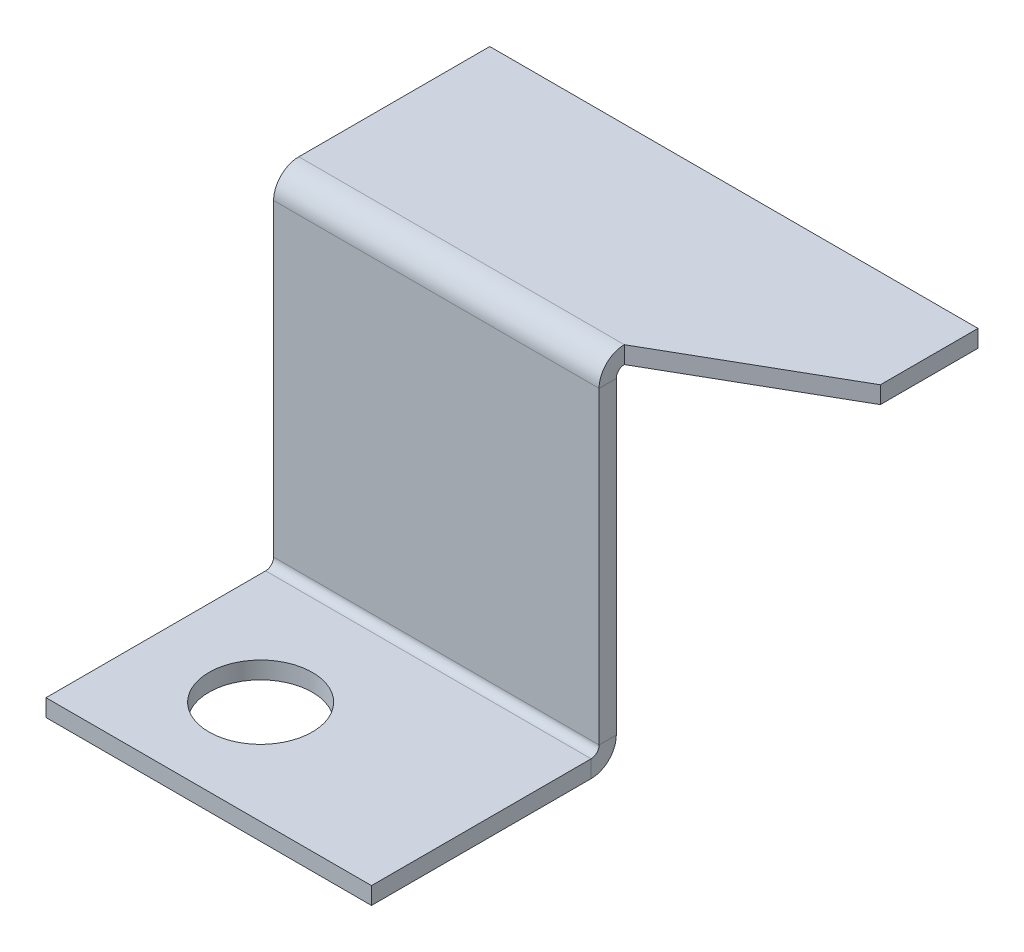
ISO-10303-21;
HEADER;
FILE_DESCRIPTION(('STEP AP214'),'2;1');
FILE_NAME('part.step','',(''),(''),'','','');
FILE_SCHEMA(('AUTOMOTIVE_DESIGN { 1 0 10303 214 1 1 1 1 }'));
ENDSEC;
DATA;
#1=APPLICATION_CONTEXT('core data for automotive mechanical design processes');
#2=APPLICATION_PROTOCOL_DEFINITION('international standard','automotive_design',2000,#1);
#3=PRODUCT_CONTEXT('',#1,'mechanical');
#4=PRODUCT('Part','Part','',(#3));
#5=PRODUCT_RELATED_PRODUCT_CATEGORY('part','',(#4));
#6=PRODUCT_DEFINITION_FORMATION('','',#4);
#7=PRODUCT_DEFINITION_CONTEXT('part definition',#1,'design');
#8=PRODUCT_DEFINITION('design','',#6,#7);
#9=PRODUCT_DEFINITION_SHAPE('','',#8);
#10=(LENGTH_UNIT() NAMED_UNIT(*) SI_UNIT(.MILLI.,.METRE.));
#11=(NAMED_UNIT(*) PLANE_ANGLE_UNIT() SI_UNIT($,.RADIAN.));
#12=(NAMED_UNIT(*) SI_UNIT($,.STERADIAN.) SOLID_ANGLE_UNIT());
#13=UNCERTAINTY_MEASURE_WITH_UNIT(LENGTH_MEASURE(1.E-05),#10,'distance_accuracy_value','');
#14=(GEOMETRIC_REPRESENTATION_CONTEXT(3) GLOBAL_UNCERTAINTY_ASSIGNED_CONTEXT((#13)) GLOBAL_UNIT_ASSIGNED_CONTEXT((#10,
#11,#12)) REPRESENTATION_CONTEXT('',''));
#15=CARTESIAN_POINT('',(0.,0.,0.));
#16=DIRECTION('',(0.,0.,1.));
#17=DIRECTION('',(1.,0.,0.));
#18=AXIS2_PLACEMENT_3D('',#15,#16,#17);
#19=CARTESIAN_POINT('',(-22.5,-33.1134,19.9241000000001));
#20=DIRECTION('',(1.,0.,0.));
#21=DIRECTION('',(0.,1.,0.));
#22=AXIS2_PLACEMENT_3D('',#19,#20,#21);
#23=PLANE('',#22);
#24=DIRECTION('',(0.,0.,-1.));
#25=VECTOR('',#24,1.);
#26=CARTESIAN_POINT('',(-22.5,-30.7893,19.9241000000001));
#27=LINE('',#26,#25);
#28=CARTESIAN_POINT('',(-22.5,-30.7893,19.9241000000001));
#29=VERTEX_POINT('',#28);
#30=CARTESIAN_POINT('',(-22.5,-30.7893,18.3366000000001));
#31=VERTEX_POINT('',#30);
#32=EDGE_CURVE('E244',#29,#31,#27,.T.);
#33=ORIENTED_EDGE('',*,*,#32,.F.);
#34=DIRECTION('',(0.,-1.,0.));
#35=VECTOR('',#34,1.);
#36=CARTESIAN_POINT('',(-22.5,0.,19.9241));
#37=LINE('',#36,#35);
#38=CARTESIAN_POINT('',(-22.5,-2.3241,19.9241));
#39=VERTEX_POINT('',#38);
#40=EDGE_CURVE('E252',#39,#29,#37,.T.);
#41=ORIENTED_EDGE('',*,*,#40,.F.);
#42=DIRECTION('',(0.,0.,-1.));
#43=VECTOR('',#42,1.);
#44=CARTESIAN_POINT('',(-22.5,-2.3241,18.3366));
#45=LINE('',#44,#43);
#46=CARTESIAN_POINT('',(-22.5,-2.32409999999999,18.3366));
#47=VERTEX_POINT('',#46);
#48=EDGE_CURVE('E262',#47,#39,#45,.F.);
#49=ORIENTED_EDGE('',*,*,#48,.F.);
#50=DIRECTION('',(0.,1.,0.));
#51=VECTOR('',#50,1.);
#52=CARTESIAN_POINT('',(-22.5,-33.1134,18.3366000000001));
#53=LINE('',#52,#51);
#54=EDGE_CURVE('E257',#47,#31,#53,.F.);
#55=ORIENTED_EDGE('',*,*,#54,.T.);
#56=EDGE_LOOP('',(#33,#41,#49,#55));
#57=FACE_BOUND('',#56,.T.);
#58=ADVANCED_FACE('F79',(#57),#23,.F.);
#59=CARTESIAN_POINT('',(7.5,-1.58749999999999,19.9241));
#60=DIRECTION('',(-1.,0.,0.));
#61=DIRECTION('',(0.,0.,1.));
#62=AXIS2_PLACEMENT_3D('',#59,#60,#61);
#63=PLANE('',#62);
#64=DIRECTION('',(0.,0.,-1.));
#65=VECTOR('',#64,1.);
#66=CARTESIAN_POINT('',(7.5,-30.7893,19.9241000000001));
#67=LINE('',#66,#65);
#68=CARTESIAN_POINT('',(7.5,-30.7893,19.9241000000001));
#69=VERTEX_POINT('',#68);
#70=CARTESIAN_POINT('',(7.5,-30.7893,18.3366000000001));
#71=VERTEX_POINT('',#70);
#72=EDGE_CURVE('E233',#69,#71,#67,.T.);
#73=ORIENTED_EDGE('',*,*,#72,.T.);
#74=DIRECTION('',(0.,-1.,0.));
#75=VECTOR('',#74,1.);
#76=CARTESIAN_POINT('',(7.5,-1.5875,18.3366));
#77=LINE('',#76,#75);
#78=CARTESIAN_POINT('',(7.5,-2.32409999999999,18.3366));
#79=VERTEX_POINT('',#78);
#80=EDGE_CURVE('E255',#71,#79,#77,.F.);
#81=ORIENTED_EDGE('',*,*,#80,.T.);
#82=DIRECTION('',(0.,0.,-1.));
#83=VECTOR('',#82,1.);
#84=CARTESIAN_POINT('',(7.5,-2.3241,19.9241));
#85=LINE('',#84,#83);
#86=CARTESIAN_POINT('',(7.5,-2.32409999999999,19.9241));
#87=VERTEX_POINT('',#86);
#88=EDGE_CURVE('E246',#79,#87,#85,.F.);
#89=ORIENTED_EDGE('',*,*,#88,.T.);
#90=DIRECTION('',(0.,1.,0.));
#91=VECTOR('',#90,1.);
#92=CARTESIAN_POINT('',(7.5,0.,19.9241));
#93=LINE('',#92,#91);
#94=EDGE_CURVE('E249',#69,#87,#93,.T.);
#95=ORIENTED_EDGE('',*,*,#94,.F.);
#96=EDGE_LOOP('',(#73,#81,#89,#95));
#97=FACE_BOUND('',#96,.T.);
#98=ADVANCED_FACE('F336',(#97),#63,.F.);
#99=CARTESIAN_POINT('',(0.,0.,19.9241));
#100=DIRECTION('',(0.,0.,-1.));
#101=DIRECTION('',(0.,1.,0.));
#102=AXIS2_PLACEMENT_3D('',#99,#100,#101);
#103=PLANE('',#102);
#104=DIRECTION('',(1.,0.,0.));
#105=VECTOR('',#104,1.);
#106=CARTESIAN_POINT('',(7.5,-30.7893,19.9241000000001));
#107=LINE('',#106,#105);
#108=EDGE_CURVE('E239',#69,#29,#107,.F.);
#109=ORIENTED_EDGE('',*,*,#108,.F.);
#110=ORIENTED_EDGE('',*,*,#94,.T.);
#111=DIRECTION('',(-1.,0.,0.));
#112=VECTOR('',#111,1.);
#113=CARTESIAN_POINT('',(7.5,-2.3241,19.9241));
#114=LINE('',#113,#112);
#115=EDGE_CURVE('E260',#39,#87,#114,.F.);
#116=ORIENTED_EDGE('',*,*,#115,.F.);
#117=ORIENTED_EDGE('',*,*,#40,.T.);
#118=EDGE_LOOP('',(#109,#110,#116,#117));
#119=FACE_BOUND('',#118,.T.);
#120=ADVANCED_FACE('F346',(#119),#103,.F.);
#121=CARTESIAN_POINT('',(0.,0.,18.3366));
#122=DIRECTION('',(0.,0.,-1.));
#123=DIRECTION('',(0.,1.,0.));
#124=AXIS2_PLACEMENT_3D('',#121,#122,#123);
#125=PLANE('',#124);
#126=ORIENTED_EDGE('',*,*,#80,.F.);
#127=DIRECTION('',(1.,0.,0.));
#128=VECTOR('',#127,1.);
#129=CARTESIAN_POINT('',(7.5,-30.7893,18.3366000000001));
#130=LINE('',#129,#128);
#131=EDGE_CURVE('E228',#71,#31,#130,.F.);
#132=ORIENTED_EDGE('',*,*,#131,.T.);
#133=ORIENTED_EDGE('',*,*,#54,.F.);
#134=DIRECTION('',(-1.,0.,0.));
#135=VECTOR('',#134,1.);
#136=CARTESIAN_POINT('',(7.5,-2.3241,18.3366));
#137=LINE('',#136,#135);
#138=EDGE_CURVE('E265',#79,#47,#137,.T.);
#139=ORIENTED_EDGE('',*,*,#138,.F.);
#140=EDGE_LOOP('',(#126,#132,#133,#139));
#141=FACE_BOUND('',#140,.T.);
#142=ADVANCED_FACE('F339',(#141),#125,.T.);
#143=CARTESIAN_POINT('',(22.5,-1.5875,9.));
#144=DIRECTION('',(0.497384112444042,0.,0.867530428681468));
#145=DIRECTION('',(0.867530428681468,0.,-0.497384112444042));
#146=AXIS2_PLACEMENT_3D('',#143,#144,#145);
#147=PLANE('',#146);
#148=DIRECTION('',(0.867530428681468,0.,-0.497384112444042));
#149=VECTOR('',#148,1.);
#150=CARTESIAN_POINT('',(22.5,0.,9.));
#151=LINE('',#150,#149);
#152=CARTESIAN_POINT('',(7.5,0.,17.6));
#153=VERTEX_POINT('',#152);
#154=CARTESIAN_POINT('',(22.5,0.,9.));
#155=VERTEX_POINT('',#154);
#156=EDGE_CURVE('E270',#153,#155,#151,.T.);
#157=ORIENTED_EDGE('',*,*,#156,.F.);
#158=DIRECTION('',(0.,1.,0.));
#159=VECTOR('',#158,1.);
#160=CARTESIAN_POINT('',(7.5,-1.5875,17.6));
#161=LINE('',#160,#159);
#162=CARTESIAN_POINT('',(7.5,-1.5875,17.6));
#163=VERTEX_POINT('',#162);
#164=EDGE_CURVE('E13',#163,#153,#161,.T.);
#165=ORIENTED_EDGE('',*,*,#164,.F.);
#166=DIRECTION('',(0.867530428681468,0.,-0.497384112444042));
#167=VECTOR('',#166,1.);
#168=CARTESIAN_POINT('',(22.5,-1.5875,9.));
#169=LINE('',#168,#167);
#170=CARTESIAN_POINT('',(22.5,-1.5875,9.));
#171=VERTEX_POINT('',#170);
#172=EDGE_CURVE('E279',#163,#171,#169,.T.);
#173=ORIENTED_EDGE('',*,*,#172,.T.);
#174=DIRECTION('',(0.,1.,0.));
#175=VECTOR('',#174,1.);
#176=CARTESIAN_POINT('',(22.5,-1.5875,9.));
#177=LINE('',#176,#175);
#178=EDGE_CURVE('E83',#171,#155,#177,.T.);
#179=ORIENTED_EDGE('',*,*,#178,.T.);
#180=EDGE_LOOP('',(#157,#165,#173,#179));
#181=FACE_BOUND('',#180,.T.);
#182=ADVANCED_FACE('F81',(#181),#147,.T.);
#183=CARTESIAN_POINT('',(-22.5,-1.5875,9.));
#184=DIRECTION('',(-1.,0.,0.));
#185=DIRECTION('',(0.,0.,1.));
#186=AXIS2_PLACEMENT_3D('',#183,#184,#185);
#187=PLANE('',#186);
#188=DIRECTION('',(0.,0.,1.));
#189=VECTOR('',#188,1.);
#190=CARTESIAN_POINT('',(-22.5,0.,9.));
#191=LINE('',#190,#189);
#192=CARTESIAN_POINT('',(-22.5,0.,0.));
#193=VERTEX_POINT('',#192);
#194=CARTESIAN_POINT('',(-22.5,0.,17.6));
#195=VERTEX_POINT('',#194);
#196=EDGE_CURVE('E300',#193,#195,#191,.T.);
#197=ORIENTED_EDGE('',*,*,#196,.F.);
#198=DIRECTION('',(0.,1.,0.));
#199=VECTOR('',#198,1.);
#200=CARTESIAN_POINT('',(-22.5,-1.5875,0.));
#201=LINE('',#200,#199);
#202=CARTESIAN_POINT('',(-22.5,-1.5875,0.));
#203=VERTEX_POINT('',#202);
#204=EDGE_CURVE('E105',#203,#193,#201,.T.);
#205=ORIENTED_EDGE('',*,*,#204,.F.);
#206=DIRECTION('',(0.,0.,1.));
#207=VECTOR('',#206,1.);
#208=CARTESIAN_POINT('',(-22.5,-1.5875,0.));
#209=LINE('',#208,#207);
#210=CARTESIAN_POINT('',(-22.5,-1.5875,17.6));
#211=VERTEX_POINT('',#210);
#212=EDGE_CURVE('E288',#203,#211,#209,.T.);
#213=ORIENTED_EDGE('',*,*,#212,.T.);
#214=DIRECTION('',(0.,1.,0.));
#215=VECTOR('',#214,1.);
#216=CARTESIAN_POINT('',(-22.5,-1.5875,17.6));
#217=LINE('',#216,#215);
#218=EDGE_CURVE('E88',#211,#195,#217,.T.);
#219=ORIENTED_EDGE('',*,*,#218,.T.);
#220=EDGE_LOOP('',(#197,#205,#213,#219));
#221=FACE_BOUND('',#220,.T.);
#222=ADVANCED_FACE('F322',(#221),#187,.T.);
#223=CARTESIAN_POINT('',(-22.5,-1.5875,0.));
#224=DIRECTION('',(0.,0.,-1.));
#225=DIRECTION('',(-1.,0.,0.));
#226=AXIS2_PLACEMENT_3D('',#223,#224,#225);
#227=PLANE('',#226);
#228=DIRECTION('',(-1.,0.,0.));
#229=VECTOR('',#228,1.);
#230=CARTESIAN_POINT('',(-22.5,0.,0.));
#231=LINE('',#230,#229);
#232=CARTESIAN_POINT('',(22.5,0.,0.));
#233=VERTEX_POINT('',#232);
#234=EDGE_CURVE('E297',#233,#193,#231,.T.);
#235=ORIENTED_EDGE('',*,*,#234,.F.);
#236=DIRECTION('',(0.,1.,0.));
#237=VECTOR('',#236,1.);
#238=CARTESIAN_POINT('',(22.5,-1.5875,0.));
#239=LINE('',#238,#237);
#240=CARTESIAN_POINT('',(22.5,-1.5875,0.));
#241=VERTEX_POINT('',#240);
#242=EDGE_CURVE('E307',#241,#233,#239,.T.);
#243=ORIENTED_EDGE('',*,*,#242,.F.);
#244=DIRECTION('',(-1.,0.,0.));
#245=VECTOR('',#244,1.);
#246=CARTESIAN_POINT('',(-22.5,-1.5875,0.));
#247=LINE('',#246,#245);
#248=EDGE_CURVE('E285',#241,#203,#247,.T.);
#249=ORIENTED_EDGE('',*,*,#248,.T.);
#250=ORIENTED_EDGE('',*,*,#204,.T.);
#251=EDGE_LOOP('',(#235,#243,#249,#250));
#252=FACE_BOUND('',#251,.T.);
#253=ADVANCED_FACE('F386',(#252),#227,.T.);
#254=CARTESIAN_POINT('',(22.5,-1.5875,0.));
#255=DIRECTION('',(1.,0.,0.));
#256=DIRECTION('',(0.,0.,-1.));
#257=AXIS2_PLACEMENT_3D('',#254,#255,#256);
#258=PLANE('',#257);
#259=DIRECTION('',(0.,0.,-1.));
#260=VECTOR('',#259,1.);
#261=CARTESIAN_POINT('',(22.5,0.,0.));
#262=LINE('',#261,#260);
#263=EDGE_CURVE('E294',#155,#233,#262,.T.);
#264=ORIENTED_EDGE('',*,*,#263,.F.);
#265=ORIENTED_EDGE('',*,*,#178,.F.);
#266=DIRECTION('',(0.,0.,-1.));
#267=VECTOR('',#266,1.);
#268=CARTESIAN_POINT('',(22.5,-1.5875,0.));
#269=LINE('',#268,#267);
#270=EDGE_CURVE('E282',#171,#241,#269,.T.);
#271=ORIENTED_EDGE('',*,*,#270,.T.);
#272=ORIENTED_EDGE('',*,*,#242,.T.);
#273=EDGE_LOOP('',(#264,#265,#271,#272));
#274=FACE_BOUND('',#273,.T.);
#275=ADVANCED_FACE('F313',(#274),#258,.T.);
#276=CARTESIAN_POINT('',(0.,-1.5875,0.));
#277=DIRECTION('',(0.,1.,0.));
#278=DIRECTION('',(0.,0.,1.));
#279=AXIS2_PLACEMENT_3D('',#276,#277,#278);
#280=PLANE('',#279);
#281=ORIENTED_EDGE('',*,*,#172,.F.);
#282=DIRECTION('',(1.,0.,0.));
#283=VECTOR('',#282,1.);
#284=CARTESIAN_POINT('',(-22.5,-1.5875,17.6));
#285=LINE('',#284,#283);
#286=EDGE_CURVE('E290',#211,#163,#285,.T.);
#287=ORIENTED_EDGE('',*,*,#286,.F.);
#288=ORIENTED_EDGE('',*,*,#212,.F.);
#289=ORIENTED_EDGE('',*,*,#248,.F.);
#290=ORIENTED_EDGE('',*,*,#270,.F.);
#291=EDGE_LOOP('',(#281,#287,#288,#289,#290));
#292=FACE_BOUND('',#291,.T.);
#293=ADVANCED_FACE('F326',(#292),#280,.F.);
#294=CARTESIAN_POINT('',(0.,0.,0.));
#295=DIRECTION('',(0.,1.,0.));
#296=DIRECTION('',(0.,0.,1.));
#297=AXIS2_PLACEMENT_3D('',#294,#295,#296);
#298=PLANE('',#297);
#299=ORIENTED_EDGE('',*,*,#156,.T.);
#300=ORIENTED_EDGE('',*,*,#263,.T.);
#301=ORIENTED_EDGE('',*,*,#234,.T.);
#302=ORIENTED_EDGE('',*,*,#196,.T.);
#303=DIRECTION('',(1.,0.,0.));
#304=VECTOR('',#303,1.);
#305=CARTESIAN_POINT('',(-22.5,0.,17.6));
#306=LINE('',#305,#304);
#307=EDGE_CURVE('E283',#195,#153,#306,.T.);
#308=ORIENTED_EDGE('',*,*,#307,.T.);
#309=EDGE_LOOP('',(#299,#300,#301,#302,#308));
#310=FACE_BOUND('',#309,.T.);
#311=ADVANCED_FACE('F315',(#310),#298,.T.);
#312=CARTESIAN_POINT('',(7.5,-2.3241,17.6));
#313=DIRECTION('',(1.,0.,0.));
#314=DIRECTION('',(0.,0.,-1.));
#315=AXIS2_PLACEMENT_3D('',#312,#313,#314);
#316=PLANE('',#315);
#317=ORIENTED_EDGE('',*,*,#88,.F.);
#318=CARTESIAN_POINT('',(7.5,-2.3241,17.6));
#319=DIRECTION('',(-1.,0.,0.));
#320=DIRECTION('',(0.,0.,1.));
#321=AXIS2_PLACEMENT_3D('',#318,#319,#320);
#322=CIRCLE('',#321,0.7366);
#323=EDGE_CURVE('E274',#163,#79,#322,.F.);
#324=ORIENTED_EDGE('',*,*,#323,.F.);
#325=ORIENTED_EDGE('',*,*,#164,.T.);
#326=CARTESIAN_POINT('',(7.5,-2.3241,17.6));
#327=DIRECTION('',(-1.,0.,0.));
#328=DIRECTION('',(0.,0.,1.));
#329=AXIS2_PLACEMENT_3D('',#326,#327,#328);
#330=CIRCLE('',#329,2.3241);
#331=EDGE_CURVE('E126',#153,#87,#330,.F.);
#332=ORIENTED_EDGE('',*,*,#331,.T.);
#333=EDGE_LOOP('',(#317,#324,#325,#332));
#334=FACE_BOUND('',#333,.T.);
#335=ADVANCED_FACE('F333',(#334),#316,.T.);
#336=CARTESIAN_POINT('',(-22.5,-2.3241,17.6));
#337=DIRECTION('',(1.,0.,0.));
#338=DIRECTION('',(0.,0.,-1.));
#339=AXIS2_PLACEMENT_3D('',#336,#337,#338);
#340=PLANE('',#339);
#341=CARTESIAN_POINT('',(-22.5,-2.3241,17.6));
#342=DIRECTION('',(-1.,0.,0.));
#343=DIRECTION('',(0.,0.,1.));
#344=AXIS2_PLACEMENT_3D('',#341,#342,#343);
#345=CIRCLE('',#344,0.7366);
#346=EDGE_CURVE('E251',#47,#211,#345,.T.);
#347=ORIENTED_EDGE('',*,*,#346,.F.);
#348=ORIENTED_EDGE('',*,*,#48,.T.);
#349=CARTESIAN_POINT('',(-22.5,-2.3241,17.6));
#350=DIRECTION('',(-1.,0.,0.));
#351=DIRECTION('',(0.,0.,1.));
#352=AXIS2_PLACEMENT_3D('',#349,#350,#351);
#353=CIRCLE('',#352,2.3241);
#354=EDGE_CURVE('E271',#39,#195,#353,.T.);
#355=ORIENTED_EDGE('',*,*,#354,.T.);
#356=ORIENTED_EDGE('',*,*,#218,.F.);
#357=EDGE_LOOP('',(#347,#348,#355,#356));
#358=FACE_BOUND('',#357,.T.);
#359=ADVANCED_FACE('F319',(#358),#340,.F.);
#360=CARTESIAN_POINT('',(-22.5,-2.3241,17.6));
#361=DIRECTION('',(-1.,0.,0.));
#362=DIRECTION('',(0.,0.,1.));
#363=AXIS2_PLACEMENT_3D('',#360,#361,#362);
#364=CYLINDRICAL_SURFACE('',#363,2.3241);
#365=ORIENTED_EDGE('',*,*,#307,.F.);
#366=ORIENTED_EDGE('',*,*,#354,.F.);
#367=ORIENTED_EDGE('',*,*,#115,.T.);
#368=ORIENTED_EDGE('',*,*,#331,.F.);
#369=EDGE_LOOP('',(#365,#366,#367,#368));
#370=FACE_BOUND('',#369,.T.);
#371=ADVANCED_FACE('F316',(#370),#364,.T.);
#372=CARTESIAN_POINT('',(-22.5,-2.3241,17.6));
#373=DIRECTION('',(-1.,0.,0.));
#374=DIRECTION('',(0.,0.,1.));
#375=AXIS2_PLACEMENT_3D('',#372,#373,#374);
#376=CYLINDRICAL_SURFACE('',#375,0.7366);
#377=ORIENTED_EDGE('',*,*,#286,.T.);
#378=ORIENTED_EDGE('',*,*,#323,.T.);
#379=ORIENTED_EDGE('',*,*,#138,.T.);
#380=ORIENTED_EDGE('',*,*,#346,.T.);
#381=EDGE_LOOP('',(#377,#378,#379,#380));
#382=FACE_BOUND('',#381,.T.);
#383=ADVANCED_FACE('F329',(#382),#376,.F.);
#384=CARTESIAN_POINT('',(-22.5,-30.7893,20.6607000000001));
#385=DIRECTION('',(-1.,0.,0.));
#386=DIRECTION('',(0.,0.,1.));
#387=AXIS2_PLACEMENT_3D('',#384,#385,#386);
#388=PLANE('',#387);
#389=DIRECTION('',(0.,1.,0.));
#390=VECTOR('',#389,1.);
#391=CARTESIAN_POINT('',(-22.5,-33.1134,20.6607000000001));
#392=LINE('',#391,#390);
#393=CARTESIAN_POINT('',(-22.5,-31.5259,20.6607000000001));
#394=VERTEX_POINT('',#393);
#395=CARTESIAN_POINT('',(-22.5,-33.1134,20.6607000000001));
#396=VERTEX_POINT('',#395);
#397=EDGE_CURVE('E209',#394,#396,#392,.F.);
#398=ORIENTED_EDGE('',*,*,#397,.F.);
#399=CARTESIAN_POINT('',(-22.5,-30.7893,20.6607000000001));
#400=DIRECTION('',(1.,0.,0.));
#401=DIRECTION('',(0.,0.,-1.));
#402=AXIS2_PLACEMENT_3D('',#399,#400,#401);
#403=CIRCLE('',#402,0.7366);
#404=EDGE_CURVE('E236',#29,#394,#403,.F.);
#405=ORIENTED_EDGE('',*,*,#404,.F.);
#406=ORIENTED_EDGE('',*,*,#32,.T.);
#407=CARTESIAN_POINT('',(-22.5,-30.7893,20.6607000000001));
#408=DIRECTION('',(1.,0.,0.));
#409=DIRECTION('',(0.,0.,-1.));
#410=AXIS2_PLACEMENT_3D('',#407,#408,#409);
#411=CIRCLE('',#410,2.3241);
#412=EDGE_CURVE('E96',#31,#396,#411,.F.);
#413=ORIENTED_EDGE('',*,*,#412,.T.);
#414=EDGE_LOOP('',(#398,#405,#406,#413));
#415=FACE_BOUND('',#414,.T.);
#416=ADVANCED_FACE('F353',(#415),#388,.T.);
#417=CARTESIAN_POINT('',(7.5,-30.7893,20.6607000000001));
#418=DIRECTION('',(-1.,0.,0.));
#419=DIRECTION('',(0.,0.,1.));
#420=AXIS2_PLACEMENT_3D('',#417,#418,#419);
#421=PLANE('',#420);
#422=CARTESIAN_POINT('',(7.5,-30.7893,20.6607000000001));
#423=DIRECTION('',(1.,0.,0.));
#424=DIRECTION('',(0.,0.,-1.));
#425=AXIS2_PLACEMENT_3D('',#422,#423,#424);
#426=CIRCLE('',#425,0.7366);
#427=CARTESIAN_POINT('',(7.5,-31.5259,20.6607000000001));
#428=VERTEX_POINT('',#427);
#429=EDGE_CURVE('E241',#428,#69,#426,.T.);
#430=ORIENTED_EDGE('',*,*,#429,.F.);
#431=DIRECTION('',(0.,1.,0.));
#432=VECTOR('',#431,1.);
#433=CARTESIAN_POINT('',(7.5,-31.5259,20.6607000000001));
#434=LINE('',#433,#432);
#435=CARTESIAN_POINT('',(7.5,-33.1134,20.6607000000001));
#436=VERTEX_POINT('',#435);
#437=EDGE_CURVE('E221',#428,#436,#434,.F.);
#438=ORIENTED_EDGE('',*,*,#437,.T.);
#439=CARTESIAN_POINT('',(7.5,-30.7893,20.6607000000001));
#440=DIRECTION('',(1.,0.,0.));
#441=DIRECTION('',(0.,0.,-1.));
#442=AXIS2_PLACEMENT_3D('',#439,#440,#441);
#443=CIRCLE('',#442,2.3241);
#444=EDGE_CURVE('E231',#436,#71,#443,.T.);
#445=ORIENTED_EDGE('',*,*,#444,.T.);
#446=ORIENTED_EDGE('',*,*,#72,.F.);
#447=EDGE_LOOP('',(#430,#438,#445,#446));
#448=FACE_BOUND('',#447,.T.);
#449=ADVANCED_FACE('F355',(#448),#421,.F.);
#450=CARTESIAN_POINT('',(7.5,-30.7893,20.6607000000001));
#451=DIRECTION('',(1.,0.,0.));
#452=DIRECTION('',(0.,-1.,0.));
#453=AXIS2_PLACEMENT_3D('',#450,#451,#452);
#454=CYLINDRICAL_SURFACE('',#453,2.3241);
#455=ORIENTED_EDGE('',*,*,#131,.F.);
#456=ORIENTED_EDGE('',*,*,#444,.F.);
#457=DIRECTION('',(1.,0.,0.));
#458=VECTOR('',#457,1.);
#459=CARTESIAN_POINT('',(-22.5,-33.1134,20.6607000000001));
#460=LINE('',#459,#458);
#461=EDGE_CURVE('E219',#436,#396,#460,.F.);
#462=ORIENTED_EDGE('',*,*,#461,.T.);
#463=ORIENTED_EDGE('',*,*,#412,.F.);
#464=EDGE_LOOP('',(#455,#456,#462,#463));
#465=FACE_BOUND('',#464,.T.);
#466=ADVANCED_FACE('F361',(#465),#454,.T.);
#467=CARTESIAN_POINT('',(7.5,-30.7893,20.6607000000001));
#468=DIRECTION('',(1.,0.,0.));
#469=DIRECTION('',(0.,-1.,0.));
#470=AXIS2_PLACEMENT_3D('',#467,#468,#469);
#471=CYLINDRICAL_SURFACE('',#470,0.7366);
#472=ORIENTED_EDGE('',*,*,#108,.T.);
#473=ORIENTED_EDGE('',*,*,#404,.T.);
#474=DIRECTION('',(1.,0.,0.));
#475=VECTOR('',#474,1.);
#476=CARTESIAN_POINT('',(-22.5,-31.5259,20.6607000000001));
#477=LINE('',#476,#475);
#478=EDGE_CURVE('E224',#394,#428,#477,.T.);
#479=ORIENTED_EDGE('',*,*,#478,.T.);
#480=ORIENTED_EDGE('',*,*,#429,.T.);
#481=EDGE_LOOP('',(#472,#473,#479,#480));
#482=FACE_BOUND('',#481,.T.);
#483=ADVANCED_FACE('F349',(#482),#471,.F.);
#484=CARTESIAN_POINT('',(7.5,-33.1134,40.9020000000001));
#485=DIRECTION('',(-1.,0.,0.));
#486=DIRECTION('',(0.,0.,1.));
#487=AXIS2_PLACEMENT_3D('',#484,#485,#486);
#488=PLANE('',#487);
#489=ORIENTED_EDGE('',*,*,#437,.F.);
#490=DIRECTION('',(0.,0.,-1.));
#491=VECTOR('',#490,1.);
#492=CARTESIAN_POINT('',(7.5,-31.5259,40.9020000000001));
#493=LINE('',#492,#491);
#494=CARTESIAN_POINT('',(7.5,-31.5259,40.9020000000001));
#495=VERTEX_POINT('',#494);
#496=EDGE_CURVE('E217',#428,#495,#493,.F.);
#497=ORIENTED_EDGE('',*,*,#496,.T.);
#498=DIRECTION('',(0.,1.,0.));
#499=VECTOR('',#498,1.);
#500=CARTESIAN_POINT('',(7.5,-33.1134,40.9020000000001));
#501=LINE('',#500,#499);
#502=CARTESIAN_POINT('',(7.5,-33.1134,40.9020000000001));
#503=VERTEX_POINT('',#502);
#504=EDGE_CURVE('E205',#503,#495,#501,.T.);
#505=ORIENTED_EDGE('',*,*,#504,.F.);
#506=DIRECTION('',(0.,0.,1.));
#507=VECTOR('',#506,1.);
#508=CARTESIAN_POINT('',(7.5,-33.1134,0.));
#509=LINE('',#508,#507);
#510=EDGE_CURVE('E192',#436,#503,#509,.T.);
#511=ORIENTED_EDGE('',*,*,#510,.F.);
#512=EDGE_LOOP('',(#489,#497,#505,#511));
#513=FACE_BOUND('',#512,.T.);
#514=ADVANCED_FACE('F477',(#513),#488,.F.);
#515=CARTESIAN_POINT('',(-22.5,-33.1134,19.9241000000001));
#516=DIRECTION('',(1.,0.,0.));
#517=DIRECTION('',(0.,0.,-1.));
#518=AXIS2_PLACEMENT_3D('',#515,#516,#517);
#519=PLANE('',#518);
#520=ORIENTED_EDGE('',*,*,#397,.T.);
#521=DIRECTION('',(0.,0.,-1.));
#522=VECTOR('',#521,1.);
#523=CARTESIAN_POINT('',(-22.5,-33.1134,0.));
#524=LINE('',#523,#522);
#525=CARTESIAN_POINT('',(-22.5,-33.1134,40.9020000000001));
#526=VERTEX_POINT('',#525);
#527=EDGE_CURVE('E190',#526,#396,#524,.T.);
#528=ORIENTED_EDGE('',*,*,#527,.F.);
#529=DIRECTION('',(0.,1.,0.));
#530=VECTOR('',#529,1.);
#531=CARTESIAN_POINT('',(-22.5,-33.1134,40.9020000000001));
#532=LINE('',#531,#530);
#533=CARTESIAN_POINT('',(-22.5,-31.5259,40.9020000000001));
#534=VERTEX_POINT('',#533);
#535=EDGE_CURVE('E198',#526,#534,#532,.T.);
#536=ORIENTED_EDGE('',*,*,#535,.T.);
#537=DIRECTION('',(0.,0.,1.));
#538=VECTOR('',#537,1.);
#539=CARTESIAN_POINT('',(-22.5,-31.5259,19.9241000000001));
#540=LINE('',#539,#538);
#541=EDGE_CURVE('E214',#534,#394,#540,.F.);
#542=ORIENTED_EDGE('',*,*,#541,.T.);
#543=EDGE_LOOP('',(#520,#528,#536,#542));
#544=FACE_BOUND('',#543,.T.);
#545=ADVANCED_FACE('F208',(#544),#519,.F.);
#546=CARTESIAN_POINT('',(0.,-33.1134,0.));
#547=DIRECTION('',(0.,1.,0.));
#548=DIRECTION('',(0.,0.,1.));
#549=AXIS2_PLACEMENT_3D('',#546,#547,#548);
#550=PLANE('',#549);
#551=CARTESIAN_POINT('',(-12.25,-33.1134,31.3693000000001));
#552=DIRECTION('',(0.,1.,0.));
#553=DIRECTION('',(0.,0.,1.));
#554=AXIS2_PLACEMENT_3D('',#551,#552,#553);
#555=CIRCLE('',#554,4.7625);
#556=CARTESIAN_POINT('',(-12.25,-33.1134,36.1318000000001));
#557=VERTEX_POINT('',#556);
#558=EDGE_CURVE('E227',#557,#557,#555,.T.);
#559=ORIENTED_EDGE('',*,*,#558,.T.);
#560=EDGE_LOOP('',(#559));
#561=FACE_BOUND('',#560,.T.);
#562=ORIENTED_EDGE('',*,*,#461,.F.);
#563=ORIENTED_EDGE('',*,*,#510,.T.);
#564=DIRECTION('',(-1.,0.,0.));
#565=VECTOR('',#564,1.);
#566=CARTESIAN_POINT('',(0.,-33.1134,40.9020000000001));
#567=LINE('',#566,#565);
#568=EDGE_CURVE('E185',#503,#526,#567,.T.);
#569=ORIENTED_EDGE('',*,*,#568,.T.);
#570=ORIENTED_EDGE('',*,*,#527,.T.);
#571=EDGE_LOOP('',(#562,#563,#569,#570));
#572=FACE_BOUND('',#571,.T.);
#573=ADVANCED_FACE('F188',(#561,#572),#550,.F.);
#574=CARTESIAN_POINT('',(0.,-31.5259,0.));
#575=DIRECTION('',(0.,1.,0.));
#576=DIRECTION('',(0.,0.,1.));
#577=AXIS2_PLACEMENT_3D('',#574,#575,#576);
#578=PLANE('',#577);
#579=CARTESIAN_POINT('',(-12.25,-31.5259,31.3693000000001));
#580=DIRECTION('',(0.,1.,0.));
#581=DIRECTION('',(0.,0.,1.));
#582=AXIS2_PLACEMENT_3D('',#579,#580,#581);
#583=CIRCLE('',#582,4.7625);
#584=CARTESIAN_POINT('',(-12.25,-31.5259,36.1318000000001));
#585=VERTEX_POINT('',#584);
#586=EDGE_CURVE('E556',#585,#585,#583,.T.);
#587=ORIENTED_EDGE('',*,*,#586,.F.);
#588=EDGE_LOOP('',(#587));
#589=FACE_BOUND('',#588,.T.);
#590=ORIENTED_EDGE('',*,*,#496,.F.);
#591=ORIENTED_EDGE('',*,*,#478,.F.);
#592=ORIENTED_EDGE('',*,*,#541,.F.);
#593=DIRECTION('',(1.,0.,0.));
#594=VECTOR('',#593,1.);
#595=CARTESIAN_POINT('',(-22.5,-31.5259,40.9020000000001));
#596=LINE('',#595,#594);
#597=EDGE_CURVE('E201',#495,#534,#596,.F.);
#598=ORIENTED_EDGE('',*,*,#597,.F.);
#599=EDGE_LOOP('',(#590,#591,#592,#598));
#600=FACE_BOUND('',#599,.T.);
#601=ADVANCED_FACE('F508',(#589,#600),#578,.T.);
#602=CARTESIAN_POINT('',(-22.5,-33.1134,40.9020000000001));
#603=DIRECTION('',(0.,0.,-1.));
#604=DIRECTION('',(0.,1.,0.));
#605=AXIS2_PLACEMENT_3D('',#602,#603,#604);
#606=PLANE('',#605);
#607=ORIENTED_EDGE('',*,*,#597,.T.);
#608=ORIENTED_EDGE('',*,*,#535,.F.);
#609=ORIENTED_EDGE('',*,*,#568,.F.);
#610=ORIENTED_EDGE('',*,*,#504,.T.);
#611=EDGE_LOOP('',(#607,#608,#609,#610));
#612=FACE_BOUND('',#611,.T.);
#613=ADVANCED_FACE('F199',(#612),#606,.F.);
#614=CARTESIAN_POINT('',(-12.25,-33.1134,31.3693000000001));
#615=DIRECTION('',(0.,1.,0.));
#616=DIRECTION('',(0.,0.,1.));
#617=AXIS2_PLACEMENT_3D('',#614,#615,#616);
#618=CYLINDRICAL_SURFACE('',#617,4.7625);
#619=ORIENTED_EDGE('',*,*,#558,.F.);
#620=EDGE_LOOP('',(#619));
#621=FACE_BOUND('',#620,.T.);
#622=ORIENTED_EDGE('',*,*,#586,.T.);
#623=EDGE_LOOP('',(#622));
#624=FACE_BOUND('',#623,.T.);
#625=ADVANCED_FACE('F507',(#621,#624),#618,.F.);
#626=CLOSED_SHELL('',(#58,#98,#120,#142,#182,#222,#253,#275,#293,#311,#335,#359,#371,#383,#416,
#449,#466,#483,#514,#545,#573,#601,#613,#625));
#627=MANIFOLD_SOLID_BREP('B2',#626);
#628=ADVANCED_BREP_SHAPE_REPRESENTATION('',(#18,#627),#14);
#629=SHAPE_DEFINITION_REPRESENTATION(#9,#628);
ENDSEC;
END-ISO-10303-21;
